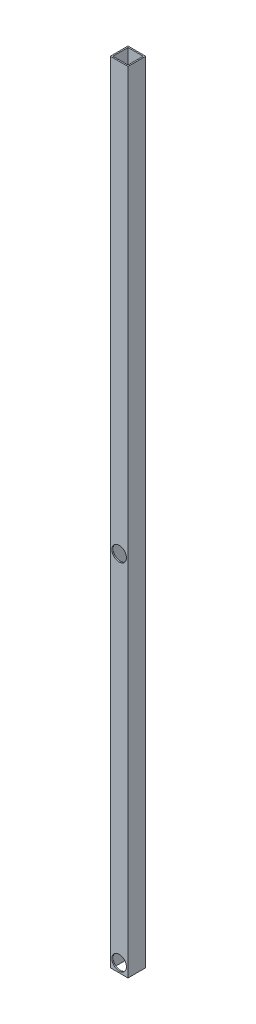
ISO-10303-21;
HEADER;
FILE_DESCRIPTION(('STEP AP214'),'2;1');
FILE_NAME('part.step','',(''),(''),'','','');
FILE_SCHEMA(('AUTOMOTIVE_DESIGN { 1 0 10303 214 1 1 1 1 }'));
ENDSEC;
DATA;
#1=APPLICATION_CONTEXT('core data for automotive mechanical design processes');
#2=APPLICATION_PROTOCOL_DEFINITION('international standard','automotive_design',2000,#1);
#3=PRODUCT_CONTEXT('',#1,'mechanical');
#4=PRODUCT('Part','Part','',(#3));
#5=PRODUCT_RELATED_PRODUCT_CATEGORY('part','',(#4));
#6=PRODUCT_DEFINITION_FORMATION('','',#4);
#7=PRODUCT_DEFINITION_CONTEXT('part definition',#1,'design');
#8=PRODUCT_DEFINITION('design','',#6,#7);
#9=PRODUCT_DEFINITION_SHAPE('','',#8);
#10=(LENGTH_UNIT() NAMED_UNIT(*) SI_UNIT(.MILLI.,.METRE.));
#11=(NAMED_UNIT(*) PLANE_ANGLE_UNIT() SI_UNIT($,.RADIAN.));
#12=(NAMED_UNIT(*) SI_UNIT($,.STERADIAN.) SOLID_ANGLE_UNIT());
#13=UNCERTAINTY_MEASURE_WITH_UNIT(LENGTH_MEASURE(1.E-05),#10,'distance_accuracy_value','');
#14=(GEOMETRIC_REPRESENTATION_CONTEXT(3) GLOBAL_UNCERTAINTY_ASSIGNED_CONTEXT((#13)) GLOBAL_UNIT_ASSIGNED_CONTEXT((#10,
#11,#12)) REPRESENTATION_CONTEXT('',''));
#15=CARTESIAN_POINT('',(0.,0.,0.));
#16=DIRECTION('',(0.,0.,1.));
#17=DIRECTION('',(1.,0.,0.));
#18=AXIS2_PLACEMENT_3D('',#15,#16,#17);
#19=CARTESIAN_POINT('',(0.,1981.2,0.));
#20=DIRECTION('',(0.,-1.,0.));
#21=DIRECTION('',(0.,0.,-1.));
#22=AXIS2_PLACEMENT_3D('',#19,#20,#21);
#23=PLANE('',#22);
#24=DIRECTION('',(0.,0.,1.));
#25=VECTOR('',#24,1.);
#26=CARTESIAN_POINT('',(0.,1981.2,0.));
#27=LINE('',#26,#25);
#28=CARTESIAN_POINT('',(0.,1981.2,-44.45));
#29=VERTEX_POINT('',#28);
#30=CARTESIAN_POINT('',(0.,1981.2,0.));
#31=VERTEX_POINT('',#30);
#32=EDGE_CURVE('E137',#29,#31,#27,.T.);
#33=ORIENTED_EDGE('',*,*,#32,.T.);
#34=DIRECTION('',(1.,0.,0.));
#35=VECTOR('',#34,1.);
#36=CARTESIAN_POINT('',(0.,1981.2,0.));
#37=LINE('',#36,#35);
#38=CARTESIAN_POINT('',(44.45,1981.2,0.));
#39=VERTEX_POINT('',#38);
#40=EDGE_CURVE('E140',#31,#39,#37,.T.);
#41=ORIENTED_EDGE('',*,*,#40,.T.);
#42=DIRECTION('',(0.,0.,-1.));
#43=VECTOR('',#42,1.);
#44=CARTESIAN_POINT('',(44.45,1981.2,0.));
#45=LINE('',#44,#43);
#46=CARTESIAN_POINT('',(44.45,1981.2,-44.45));
#47=VERTEX_POINT('',#46);
#48=EDGE_CURVE('E143',#39,#47,#45,.T.);
#49=ORIENTED_EDGE('',*,*,#48,.T.);
#50=DIRECTION('',(-1.,0.,0.));
#51=VECTOR('',#50,1.);
#52=CARTESIAN_POINT('',(0.,1981.2,-44.45));
#53=LINE('',#52,#51);
#54=EDGE_CURVE('E145',#47,#29,#53,.T.);
#55=ORIENTED_EDGE('',*,*,#54,.T.);
#56=EDGE_LOOP('',(#33,#41,#49,#55));
#57=FACE_BOUND('',#56,.T.);
#58=DIRECTION('',(1.,0.,0.));
#59=VECTOR('',#58,1.);
#60=CARTESIAN_POINT('',(3.175,1981.2,-3.175));
#61=LINE('',#60,#59);
#62=CARTESIAN_POINT('',(3.175,1981.2,-3.175));
#63=VERTEX_POINT('',#62);
#64=CARTESIAN_POINT('',(41.275,1981.2,-3.175));
#65=VERTEX_POINT('',#64);
#66=EDGE_CURVE('E99',#63,#65,#61,.T.);
#67=ORIENTED_EDGE('',*,*,#66,.F.);
#68=DIRECTION('',(0.,0.,1.));
#69=VECTOR('',#68,1.);
#70=CARTESIAN_POINT('',(3.175,1981.2,-3.175));
#71=LINE('',#70,#69);
#72=CARTESIAN_POINT('',(3.175,1981.2,-41.275));
#73=VERTEX_POINT('',#72);
#74=EDGE_CURVE('E121',#73,#63,#71,.T.);
#75=ORIENTED_EDGE('',*,*,#74,.F.);
#76=DIRECTION('',(-1.,0.,0.));
#77=VECTOR('',#76,1.);
#78=CARTESIAN_POINT('',(3.175,1981.2,-41.275));
#79=LINE('',#78,#77);
#80=CARTESIAN_POINT('',(41.275,1981.2,-41.275));
#81=VERTEX_POINT('',#80);
#82=EDGE_CURVE('E119',#81,#73,#79,.T.);
#83=ORIENTED_EDGE('',*,*,#82,.F.);
#84=DIRECTION('',(0.,0.,-1.));
#85=VECTOR('',#84,1.);
#86=CARTESIAN_POINT('',(41.275,1981.2,-3.175));
#87=LINE('',#86,#85);
#88=EDGE_CURVE('E107',#65,#81,#87,.T.);
#89=ORIENTED_EDGE('',*,*,#88,.F.);
#90=EDGE_LOOP('',(#67,#75,#83,#89));
#91=FACE_BOUND('',#90,.T.);
#92=ADVANCED_FACE('F34',(#57,#91),#23,.F.);
#93=CARTESIAN_POINT('',(0.,0.,0.));
#94=DIRECTION('',(0.,-1.,0.));
#95=DIRECTION('',(0.,0.,-1.));
#96=AXIS2_PLACEMENT_3D('',#93,#94,#95);
#97=PLANE('',#96);
#98=DIRECTION('',(0.,0.,1.));
#99=VECTOR('',#98,1.);
#100=CARTESIAN_POINT('',(0.,0.,0.));
#101=LINE('',#100,#99);
#102=CARTESIAN_POINT('',(0.,0.,-44.45));
#103=VERTEX_POINT('',#102);
#104=CARTESIAN_POINT('',(0.,0.,0.));
#105=VERTEX_POINT('',#104);
#106=EDGE_CURVE('E115',#103,#105,#101,.T.);
#107=ORIENTED_EDGE('',*,*,#106,.F.);
#108=DIRECTION('',(-1.,0.,0.));
#109=VECTOR('',#108,1.);
#110=CARTESIAN_POINT('',(0.,0.,-44.45));
#111=LINE('',#110,#109);
#112=CARTESIAN_POINT('',(44.45,0.,-44.45));
#113=VERTEX_POINT('',#112);
#114=EDGE_CURVE('E141',#113,#103,#111,.T.);
#115=ORIENTED_EDGE('',*,*,#114,.F.);
#116=DIRECTION('',(0.,0.,-1.));
#117=VECTOR('',#116,1.);
#118=CARTESIAN_POINT('',(44.45,0.,0.));
#119=LINE('',#118,#117);
#120=CARTESIAN_POINT('',(44.45,0.,0.));
#121=VERTEX_POINT('',#120);
#122=EDGE_CURVE('E152',#121,#113,#119,.T.);
#123=ORIENTED_EDGE('',*,*,#122,.F.);
#124=DIRECTION('',(1.,0.,0.));
#125=VECTOR('',#124,1.);
#126=CARTESIAN_POINT('',(0.,0.,0.));
#127=LINE('',#126,#125);
#128=EDGE_CURVE('E150',#105,#121,#127,.T.);
#129=ORIENTED_EDGE('',*,*,#128,.F.);
#130=EDGE_LOOP('',(#107,#115,#123,#129));
#131=FACE_BOUND('',#130,.T.);
#132=DIRECTION('',(0.,0.,1.));
#133=VECTOR('',#132,1.);
#134=CARTESIAN_POINT('',(3.175,0.,-3.175));
#135=LINE('',#134,#133);
#136=CARTESIAN_POINT('',(3.175,0.,-41.275));
#137=VERTEX_POINT('',#136);
#138=CARTESIAN_POINT('',(3.175,0.,-3.175));
#139=VERTEX_POINT('',#138);
#140=EDGE_CURVE('E108',#137,#139,#135,.T.);
#141=ORIENTED_EDGE('',*,*,#140,.T.);
#142=DIRECTION('',(1.,0.,0.));
#143=VECTOR('',#142,1.);
#144=CARTESIAN_POINT('',(3.175,0.,-3.175));
#145=LINE('',#144,#143);
#146=CARTESIAN_POINT('',(41.275,0.,-3.175));
#147=VERTEX_POINT('',#146);
#148=EDGE_CURVE('E57',#139,#147,#145,.T.);
#149=ORIENTED_EDGE('',*,*,#148,.T.);
#150=DIRECTION('',(0.,0.,-1.));
#151=VECTOR('',#150,1.);
#152=CARTESIAN_POINT('',(41.275,0.,-3.175));
#153=LINE('',#152,#151);
#154=CARTESIAN_POINT('',(41.275,0.,-41.275));
#155=VERTEX_POINT('',#154);
#156=EDGE_CURVE('E114',#147,#155,#153,.T.);
#157=ORIENTED_EDGE('',*,*,#156,.T.);
#158=DIRECTION('',(-1.,0.,0.));
#159=VECTOR('',#158,1.);
#160=CARTESIAN_POINT('',(3.175,0.,-41.275));
#161=LINE('',#160,#159);
#162=EDGE_CURVE('E129',#155,#137,#161,.T.);
#163=ORIENTED_EDGE('',*,*,#162,.T.);
#164=EDGE_LOOP('',(#141,#149,#157,#163));
#165=FACE_BOUND('',#164,.T.);
#166=ADVANCED_FACE('F170',(#131,#165),#97,.T.);
#167=CARTESIAN_POINT('',(0.,1981.2,0.));
#168=DIRECTION('',(1.,0.,0.));
#169=DIRECTION('',(0.,0.,-1.));
#170=AXIS2_PLACEMENT_3D('',#167,#168,#169);
#171=PLANE('',#170);
#172=ORIENTED_EDGE('',*,*,#106,.T.);
#173=DIRECTION('',(0.,-1.,0.));
#174=VECTOR('',#173,1.);
#175=CARTESIAN_POINT('',(0.,1981.2,0.));
#176=LINE('',#175,#174);
#177=EDGE_CURVE('E11',#31,#105,#176,.T.);
#178=ORIENTED_EDGE('',*,*,#177,.F.);
#179=ORIENTED_EDGE('',*,*,#32,.F.);
#180=DIRECTION('',(0.,-1.,0.));
#181=VECTOR('',#180,1.);
#182=CARTESIAN_POINT('',(0.,1981.2,-44.45));
#183=LINE('',#182,#181);
#184=EDGE_CURVE('E147',#29,#103,#183,.T.);
#185=ORIENTED_EDGE('',*,*,#184,.T.);
#186=EDGE_LOOP('',(#172,#178,#179,#185));
#187=FACE_BOUND('',#186,.T.);
#188=ADVANCED_FACE('F36',(#187),#171,.F.);
#189=CARTESIAN_POINT('',(0.,1981.2,0.));
#190=DIRECTION('',(0.,0.,-1.));
#191=DIRECTION('',(-1.,0.,0.));
#192=AXIS2_PLACEMENT_3D('',#189,#190,#191);
#193=PLANE('',#192);
#194=CARTESIAN_POINT('',(22.225,22.225,0.));
#195=DIRECTION('',(0.,0.,1.));
#196=DIRECTION('',(1.,0.,0.));
#197=AXIS2_PLACEMENT_3D('',#194,#195,#196);
#198=CIRCLE('',#197,18.25625);
#199=CARTESIAN_POINT('',(40.48125,22.225,0.));
#200=VERTEX_POINT('',#199);
#201=EDGE_CURVE('E127',#200,#200,#198,.T.);
#202=ORIENTED_EDGE('',*,*,#201,.F.);
#203=EDGE_LOOP('',(#202));
#204=FACE_BOUND('',#203,.T.);
#205=CARTESIAN_POINT('',(22.225,911.225,0.));
#206=DIRECTION('',(0.,0.,1.));
#207=DIRECTION('',(1.,0.,0.));
#208=AXIS2_PLACEMENT_3D('',#205,#206,#207);
#209=CIRCLE('',#208,18.25625);
#210=CARTESIAN_POINT('',(40.48125,911.225,0.));
#211=VERTEX_POINT('',#210);
#212=EDGE_CURVE('E225',#211,#211,#209,.T.);
#213=ORIENTED_EDGE('',*,*,#212,.F.);
#214=EDGE_LOOP('',(#213));
#215=FACE_BOUND('',#214,.T.);
#216=ORIENTED_EDGE('',*,*,#128,.T.);
#217=DIRECTION('',(0.,-1.,0.));
#218=VECTOR('',#217,1.);
#219=CARTESIAN_POINT('',(44.45,1981.2,0.));
#220=LINE('',#219,#218);
#221=EDGE_CURVE('E42',#39,#121,#220,.T.);
#222=ORIENTED_EDGE('',*,*,#221,.F.);
#223=ORIENTED_EDGE('',*,*,#40,.F.);
#224=ORIENTED_EDGE('',*,*,#177,.T.);
#225=EDGE_LOOP('',(#216,#222,#223,#224));
#226=FACE_BOUND('',#225,.T.);
#227=ADVANCED_FACE('F180',(#204,#215,#226),#193,.F.);
#228=CARTESIAN_POINT('',(44.45,1981.2,0.));
#229=DIRECTION('',(-1.,0.,0.));
#230=DIRECTION('',(0.,0.,1.));
#231=AXIS2_PLACEMENT_3D('',#228,#229,#230);
#232=PLANE('',#231);
#233=ORIENTED_EDGE('',*,*,#122,.T.);
#234=DIRECTION('',(0.,-1.,0.));
#235=VECTOR('',#234,1.);
#236=CARTESIAN_POINT('',(44.45,1981.2,-44.45));
#237=LINE('',#236,#235);
#238=EDGE_CURVE('E157',#47,#113,#237,.T.);
#239=ORIENTED_EDGE('',*,*,#238,.F.);
#240=ORIENTED_EDGE('',*,*,#48,.F.);
#241=ORIENTED_EDGE('',*,*,#221,.T.);
#242=EDGE_LOOP('',(#233,#239,#240,#241));
#243=FACE_BOUND('',#242,.T.);
#244=ADVANCED_FACE('F164',(#243),#232,.F.);
#245=CARTESIAN_POINT('',(0.,1981.2,-44.45));
#246=DIRECTION('',(0.,0.,1.));
#247=DIRECTION('',(1.,0.,0.));
#248=AXIS2_PLACEMENT_3D('',#245,#246,#247);
#249=PLANE('',#248);
#250=CARTESIAN_POINT('',(22.225,911.225,-44.45));
#251=DIRECTION('',(0.,0.,-1.));
#252=DIRECTION('',(-1.,0.,0.));
#253=AXIS2_PLACEMENT_3D('',#250,#251,#252);
#254=CIRCLE('',#253,12.7);
#255=CARTESIAN_POINT('',(9.525,911.225,-44.45));
#256=VERTEX_POINT('',#255);
#257=EDGE_CURVE('E208',#256,#256,#254,.T.);
#258=ORIENTED_EDGE('',*,*,#257,.F.);
#259=EDGE_LOOP('',(#258));
#260=FACE_BOUND('',#259,.T.);
#261=CARTESIAN_POINT('',(22.225,22.225,-44.45));
#262=DIRECTION('',(0.,0.,-1.));
#263=DIRECTION('',(-1.,0.,0.));
#264=AXIS2_PLACEMENT_3D('',#261,#262,#263);
#265=CIRCLE('',#264,12.7);
#266=CARTESIAN_POINT('',(9.525,22.225,-44.45));
#267=VERTEX_POINT('',#266);
#268=EDGE_CURVE('E211',#267,#267,#265,.T.);
#269=ORIENTED_EDGE('',*,*,#268,.F.);
#270=EDGE_LOOP('',(#269));
#271=FACE_BOUND('',#270,.T.);
#272=ORIENTED_EDGE('',*,*,#114,.T.);
#273=ORIENTED_EDGE('',*,*,#184,.F.);
#274=ORIENTED_EDGE('',*,*,#54,.F.);
#275=ORIENTED_EDGE('',*,*,#238,.T.);
#276=EDGE_LOOP('',(#272,#273,#274,#275));
#277=FACE_BOUND('',#276,.T.);
#278=ADVANCED_FACE('F174',(#260,#271,#277),#249,.F.);
#279=CARTESIAN_POINT('',(3.175,1981.2,-3.175));
#280=DIRECTION('',(0.,0.,-1.));
#281=DIRECTION('',(-1.,0.,0.));
#282=AXIS2_PLACEMENT_3D('',#279,#280,#281);
#283=PLANE('',#282);
#284=CARTESIAN_POINT('',(22.225,22.225,-3.175));
#285=DIRECTION('',(0.,0.,-1.));
#286=DIRECTION('',(-1.,0.,0.));
#287=AXIS2_PLACEMENT_3D('',#284,#285,#286);
#288=CIRCLE('',#287,18.25625);
#289=CARTESIAN_POINT('',(3.96875,22.225,-3.175));
#290=VERTEX_POINT('',#289);
#291=EDGE_CURVE('E222',#290,#290,#288,.F.);
#292=ORIENTED_EDGE('',*,*,#291,.T.);
#293=EDGE_LOOP('',(#292));
#294=FACE_BOUND('',#293,.T.);
#295=CARTESIAN_POINT('',(22.225,911.225,-3.175));
#296=DIRECTION('',(0.,0.,-1.));
#297=DIRECTION('',(-1.,0.,0.));
#298=AXIS2_PLACEMENT_3D('',#295,#296,#297);
#299=CIRCLE('',#298,18.25625);
#300=CARTESIAN_POINT('',(3.96875,911.225,-3.175));
#301=VERTEX_POINT('',#300);
#302=EDGE_CURVE('E228',#301,#301,#299,.F.);
#303=ORIENTED_EDGE('',*,*,#302,.T.);
#304=EDGE_LOOP('',(#303));
#305=FACE_BOUND('',#304,.T.);
#306=ORIENTED_EDGE('',*,*,#148,.F.);
#307=DIRECTION('',(0.,-1.,0.));
#308=VECTOR('',#307,1.);
#309=CARTESIAN_POINT('',(3.175,1981.2,-3.175));
#310=LINE('',#309,#308);
#311=EDGE_CURVE('E103',#63,#139,#310,.T.);
#312=ORIENTED_EDGE('',*,*,#311,.F.);
#313=ORIENTED_EDGE('',*,*,#66,.T.);
#314=DIRECTION('',(0.,-1.,0.));
#315=VECTOR('',#314,1.);
#316=CARTESIAN_POINT('',(41.275,1981.2,-3.175));
#317=LINE('',#316,#315);
#318=EDGE_CURVE('E102',#65,#147,#317,.T.);
#319=ORIENTED_EDGE('',*,*,#318,.T.);
#320=EDGE_LOOP('',(#306,#312,#313,#319));
#321=FACE_BOUND('',#320,.T.);
#322=ADVANCED_FACE('F101',(#294,#305,#321),#283,.T.);
#323=CARTESIAN_POINT('',(41.275,1981.2,-3.175));
#324=DIRECTION('',(-1.,0.,0.));
#325=DIRECTION('',(0.,0.,1.));
#326=AXIS2_PLACEMENT_3D('',#323,#324,#325);
#327=PLANE('',#326);
#328=ORIENTED_EDGE('',*,*,#156,.F.);
#329=ORIENTED_EDGE('',*,*,#318,.F.);
#330=ORIENTED_EDGE('',*,*,#88,.T.);
#331=DIRECTION('',(0.,-1.,0.));
#332=VECTOR('',#331,1.);
#333=CARTESIAN_POINT('',(41.275,1981.2,-41.275));
#334=LINE('',#333,#332);
#335=EDGE_CURVE('E116',#81,#155,#334,.T.);
#336=ORIENTED_EDGE('',*,*,#335,.T.);
#337=EDGE_LOOP('',(#328,#329,#330,#336));
#338=FACE_BOUND('',#337,.T.);
#339=ADVANCED_FACE('F111',(#338),#327,.T.);
#340=CARTESIAN_POINT('',(3.175,1981.2,-41.275));
#341=DIRECTION('',(0.,0.,1.));
#342=DIRECTION('',(1.,0.,0.));
#343=AXIS2_PLACEMENT_3D('',#340,#341,#342);
#344=PLANE('',#343);
#345=CARTESIAN_POINT('',(22.225,911.225,-41.275));
#346=DIRECTION('',(0.,0.,1.));
#347=DIRECTION('',(1.,0.,0.));
#348=AXIS2_PLACEMENT_3D('',#345,#346,#347);
#349=CIRCLE('',#348,12.7);
#350=CARTESIAN_POINT('',(34.925,911.225,-41.275));
#351=VERTEX_POINT('',#350);
#352=EDGE_CURVE('E213',#351,#351,#349,.F.);
#353=ORIENTED_EDGE('',*,*,#352,.T.);
#354=EDGE_LOOP('',(#353));
#355=FACE_BOUND('',#354,.T.);
#356=CARTESIAN_POINT('',(22.225,22.225,-41.275));
#357=DIRECTION('',(0.,0.,1.));
#358=DIRECTION('',(1.,0.,0.));
#359=AXIS2_PLACEMENT_3D('',#356,#357,#358);
#360=CIRCLE('',#359,12.7);
#361=CARTESIAN_POINT('',(34.925,22.225,-41.275));
#362=VERTEX_POINT('',#361);
#363=EDGE_CURVE('E214',#362,#362,#360,.F.);
#364=ORIENTED_EDGE('',*,*,#363,.T.);
#365=EDGE_LOOP('',(#364));
#366=FACE_BOUND('',#365,.T.);
#367=ORIENTED_EDGE('',*,*,#162,.F.);
#368=ORIENTED_EDGE('',*,*,#335,.F.);
#369=ORIENTED_EDGE('',*,*,#82,.T.);
#370=DIRECTION('',(0.,-1.,0.));
#371=VECTOR('',#370,1.);
#372=CARTESIAN_POINT('',(3.175,1981.2,-41.275));
#373=LINE('',#372,#371);
#374=EDGE_CURVE('E49',#73,#137,#373,.T.);
#375=ORIENTED_EDGE('',*,*,#374,.T.);
#376=EDGE_LOOP('',(#367,#368,#369,#375));
#377=FACE_BOUND('',#376,.T.);
#378=ADVANCED_FACE('F246',(#355,#366,#377),#344,.T.);
#379=CARTESIAN_POINT('',(3.175,1981.2,-3.175));
#380=DIRECTION('',(1.,0.,0.));
#381=DIRECTION('',(0.,0.,-1.));
#382=AXIS2_PLACEMENT_3D('',#379,#380,#381);
#383=PLANE('',#382);
#384=ORIENTED_EDGE('',*,*,#140,.F.);
#385=ORIENTED_EDGE('',*,*,#374,.F.);
#386=ORIENTED_EDGE('',*,*,#74,.T.);
#387=ORIENTED_EDGE('',*,*,#311,.T.);
#388=EDGE_LOOP('',(#384,#385,#386,#387));
#389=FACE_BOUND('',#388,.T.);
#390=ADVANCED_FACE('F236',(#389),#383,.T.);
#391=CARTESIAN_POINT('',(22.225,911.225,-44.451));
#392=DIRECTION('',(0.,0.,1.));
#393=DIRECTION('',(1.,0.,0.));
#394=AXIS2_PLACEMENT_3D('',#391,#392,#393);
#395=CYLINDRICAL_SURFACE('',#394,18.25625);
#396=ORIENTED_EDGE('',*,*,#302,.F.);
#397=EDGE_LOOP('',(#396));
#398=FACE_BOUND('',#397,.T.);
#399=ORIENTED_EDGE('',*,*,#212,.T.);
#400=EDGE_LOOP('',(#399));
#401=FACE_BOUND('',#400,.T.);
#402=ADVANCED_FACE('F233',(#398,#401),#395,.F.);
#403=CARTESIAN_POINT('',(22.225,22.225,-44.451));
#404=DIRECTION('',(0.,0.,1.));
#405=DIRECTION('',(1.,0.,0.));
#406=AXIS2_PLACEMENT_3D('',#403,#404,#405);
#407=CYLINDRICAL_SURFACE('',#406,18.25625);
#408=ORIENTED_EDGE('',*,*,#291,.F.);
#409=EDGE_LOOP('',(#408));
#410=FACE_BOUND('',#409,.T.);
#411=ORIENTED_EDGE('',*,*,#201,.T.);
#412=EDGE_LOOP('',(#411));
#413=FACE_BOUND('',#412,.T.);
#414=ADVANCED_FACE('F235',(#410,#413),#407,.F.);
#415=CARTESIAN_POINT('',(22.225,22.225,0.001000000000001));
#416=DIRECTION('',(0.,0.,-1.));
#417=DIRECTION('',(-1.,0.,0.));
#418=AXIS2_PLACEMENT_3D('',#415,#416,#417);
#419=CYLINDRICAL_SURFACE('',#418,12.7);
#420=ORIENTED_EDGE('',*,*,#363,.F.);
#421=EDGE_LOOP('',(#420));
#422=FACE_BOUND('',#421,.T.);
#423=ORIENTED_EDGE('',*,*,#268,.T.);
#424=EDGE_LOOP('',(#423));
#425=FACE_BOUND('',#424,.T.);
#426=ADVANCED_FACE('F243',(#422,#425),#419,.F.);
#427=CARTESIAN_POINT('',(22.225,911.225,0.001000000000001));
#428=DIRECTION('',(0.,0.,-1.));
#429=DIRECTION('',(-1.,0.,0.));
#430=AXIS2_PLACEMENT_3D('',#427,#428,#429);
#431=CYLINDRICAL_SURFACE('',#430,12.7);
#432=ORIENTED_EDGE('',*,*,#352,.F.);
#433=EDGE_LOOP('',(#432));
#434=FACE_BOUND('',#433,.T.);
#435=ORIENTED_EDGE('',*,*,#257,.T.);
#436=EDGE_LOOP('',(#435));
#437=FACE_BOUND('',#436,.T.);
#438=ADVANCED_FACE('F319',(#434,#437),#431,.F.);
#439=CLOSED_SHELL('',(#92,#166,#188,#227,#244,#278,#322,#339,#378,#390,#402,#414,#426,#438));
#440=MANIFOLD_SOLID_BREP('B2',#439);
#441=ADVANCED_BREP_SHAPE_REPRESENTATION('',(#18,#440),#14);
#442=SHAPE_DEFINITION_REPRESENTATION(#9,#441);
ENDSEC;
END-ISO-10303-21;
